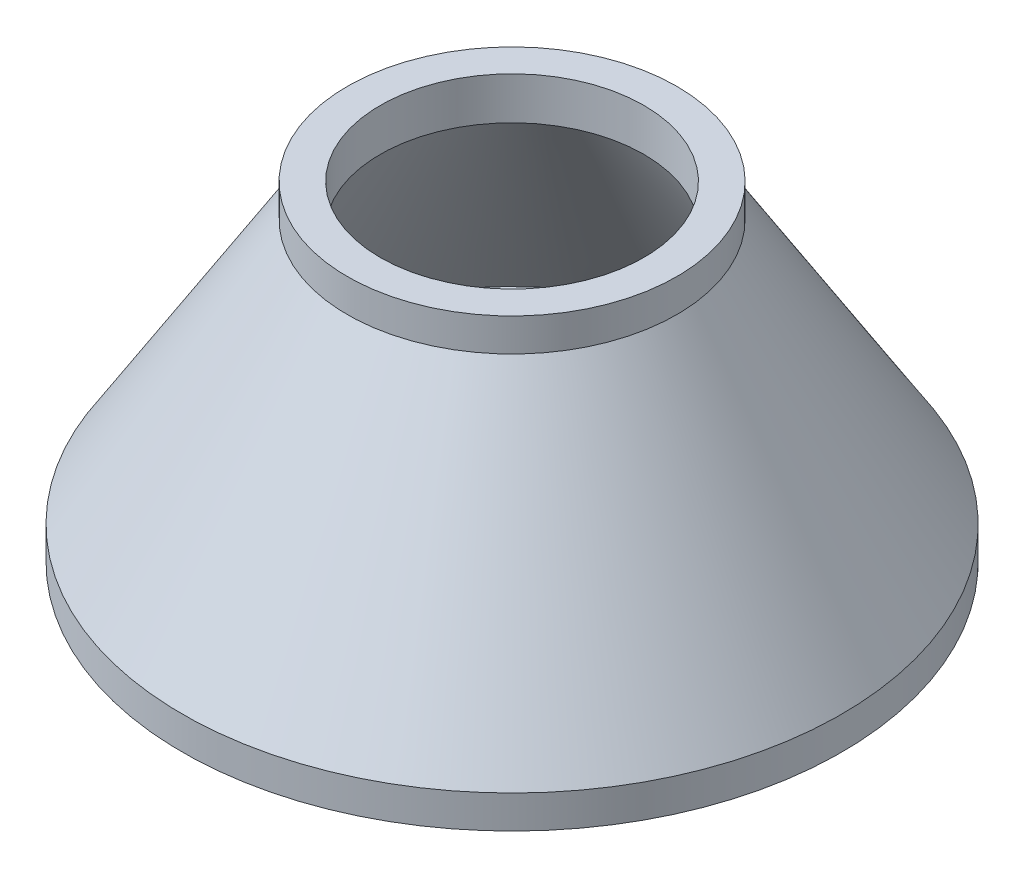
ISO-10303-21;
HEADER;
FILE_DESCRIPTION(('STEP AP214'),'2;1');
FILE_NAME('part.step','',(''),(''),'','','');
FILE_SCHEMA(('AUTOMOTIVE_DESIGN { 1 0 10303 214 1 1 1 1 }'));
ENDSEC;
DATA;
#1=APPLICATION_CONTEXT('core data for automotive mechanical design processes');
#2=APPLICATION_PROTOCOL_DEFINITION('international standard','automotive_design',2000,#1);
#3=PRODUCT_CONTEXT('',#1,'mechanical');
#4=PRODUCT('Part','Part','',(#3));
#5=PRODUCT_RELATED_PRODUCT_CATEGORY('part','',(#4));
#6=PRODUCT_DEFINITION_FORMATION('','',#4);
#7=PRODUCT_DEFINITION_CONTEXT('part definition',#1,'design');
#8=PRODUCT_DEFINITION('design','',#6,#7);
#9=PRODUCT_DEFINITION_SHAPE('','',#8);
#10=(LENGTH_UNIT() NAMED_UNIT(*) SI_UNIT(.MILLI.,.METRE.));
#11=(NAMED_UNIT(*) PLANE_ANGLE_UNIT() SI_UNIT($,.RADIAN.));
#12=(NAMED_UNIT(*) SI_UNIT($,.STERADIAN.) SOLID_ANGLE_UNIT());
#13=UNCERTAINTY_MEASURE_WITH_UNIT(LENGTH_MEASURE(1.E-05),#10,'distance_accuracy_value','');
#14=(GEOMETRIC_REPRESENTATION_CONTEXT(3) GLOBAL_UNCERTAINTY_ASSIGNED_CONTEXT((#13)) GLOBAL_UNIT_ASSIGNED_CONTEXT((#10,
#11,#12)) REPRESENTATION_CONTEXT('',''));
#15=CARTESIAN_POINT('',(0.,0.,0.));
#16=DIRECTION('',(0.,0.,1.));
#17=DIRECTION('',(1.,0.,0.));
#18=AXIS2_PLACEMENT_3D('',#15,#16,#17);
#19=CARTESIAN_POINT('',(0.,0.,0.));
#20=DIRECTION('',(0.,-1.,0.));
#21=DIRECTION('',(0.,0.,-1.));
#22=AXIS2_PLACEMENT_3D('',#19,#20,#21);
#23=PLANE('',#22);
#24=CARTESIAN_POINT('',(0.,0.,0.));
#25=DIRECTION('',(0.,-1.,0.));
#26=DIRECTION('',(0.,0.,-1.));
#27=AXIS2_PLACEMENT_3D('',#24,#25,#26);
#28=CIRCLE('',#27,100.);
#29=CARTESIAN_POINT('',(0.,0.,-100.));
#30=VERTEX_POINT('',#29);
#31=EDGE_CURVE('E10',#30,#30,#28,.T.);
#32=ORIENTED_EDGE('',*,*,#31,.T.);
#33=EDGE_LOOP('',(#32));
#34=FACE_BOUND('',#33,.T.);
#35=ADVANCED_FACE('F31',(#34),#23,.T.);
#36=CARTESIAN_POINT('',(0.,0.,0.));
#37=DIRECTION('',(0.,-1.,0.));
#38=DIRECTION('',(0.,0.,-1.));
#39=AXIS2_PLACEMENT_3D('',#36,#37,#38);
#40=CYLINDRICAL_SURFACE('',#39,100.);
#41=CARTESIAN_POINT('',(0.,10.,0.));
#42=DIRECTION('',(0.,-1.,0.));
#43=DIRECTION('',(0.,0.,-1.));
#44=AXIS2_PLACEMENT_3D('',#41,#42,#43);
#45=CIRCLE('',#44,100.);
#46=CARTESIAN_POINT('',(0.,10.,-100.));
#47=VERTEX_POINT('',#46);
#48=EDGE_CURVE('E37',#47,#47,#45,.T.);
#49=ORIENTED_EDGE('',*,*,#48,.T.);
#50=EDGE_LOOP('',(#49));
#51=FACE_BOUND('',#50,.T.);
#52=ORIENTED_EDGE('',*,*,#31,.F.);
#53=EDGE_LOOP('',(#52));
#54=FACE_BOUND('',#53,.T.);
#55=ADVANCED_FACE('F78',(#51,#54),#40,.T.);
#56=CARTESIAN_POINT('',(0.,10.,0.));
#57=DIRECTION('',(0.,-1.,0.));
#58=DIRECTION('',(0.,0.,-1.));
#59=AXIS2_PLACEMENT_3D('',#56,#57,#58);
#60=CONICAL_SURFACE('',#59,100.,0.558599315343562);
#61=CARTESIAN_POINT('',(0.,90.,0.));
#62=DIRECTION('',(0.,-1.,0.));
#63=DIRECTION('',(0.,0.,-1.));
#64=AXIS2_PLACEMENT_3D('',#61,#62,#63);
#65=CIRCLE('',#64,50.);
#66=CARTESIAN_POINT('',(0.,90.,-50.));
#67=VERTEX_POINT('',#66);
#68=EDGE_CURVE('E41',#67,#67,#65,.T.);
#69=ORIENTED_EDGE('',*,*,#68,.T.);
#70=EDGE_LOOP('',(#69));
#71=FACE_BOUND('',#70,.T.);
#72=ORIENTED_EDGE('',*,*,#48,.F.);
#73=EDGE_LOOP('',(#72));
#74=FACE_BOUND('',#73,.T.);
#75=ADVANCED_FACE('F82',(#71,#74),#60,.T.);
#76=CARTESIAN_POINT('',(0.,0.,0.));
#77=DIRECTION('',(0.,-1.,0.));
#78=DIRECTION('',(0.,0.,-1.));
#79=AXIS2_PLACEMENT_3D('',#76,#77,#78);
#80=CYLINDRICAL_SURFACE('',#79,50.);
#81=CARTESIAN_POINT('',(0.,100.,0.));
#82=DIRECTION('',(0.,-1.,0.));
#83=DIRECTION('',(0.,0.,-1.));
#84=AXIS2_PLACEMENT_3D('',#81,#82,#83);
#85=CIRCLE('',#84,50.);
#86=CARTESIAN_POINT('',(0.,100.,-50.));
#87=VERTEX_POINT('',#86);
#88=EDGE_CURVE('E45',#87,#87,#85,.T.);
#89=ORIENTED_EDGE('',*,*,#88,.T.);
#90=EDGE_LOOP('',(#89));
#91=FACE_BOUND('',#90,.T.);
#92=ORIENTED_EDGE('',*,*,#68,.F.);
#93=EDGE_LOOP('',(#92));
#94=FACE_BOUND('',#93,.T.);
#95=ADVANCED_FACE('F86',(#91,#94),#80,.T.);
#96=CARTESIAN_POINT('',(50.,100.,0.));
#97=DIRECTION('',(0.,1.,0.));
#98=DIRECTION('',(0.,0.,1.));
#99=AXIS2_PLACEMENT_3D('',#96,#97,#98);
#100=PLANE('',#99);
#101=CARTESIAN_POINT('',(0.,100.,0.));
#102=DIRECTION('',(0.,1.,0.));
#103=DIRECTION('',(0.,0.,1.));
#104=AXIS2_PLACEMENT_3D('',#101,#102,#103);
#105=CIRCLE('',#104,40.);
#106=CARTESIAN_POINT('',(0.,100.,40.));
#107=VERTEX_POINT('',#106);
#108=EDGE_CURVE('E54',#107,#107,#105,.F.);
#109=ORIENTED_EDGE('',*,*,#108,.T.);
#110=EDGE_LOOP('',(#109));
#111=FACE_BOUND('',#110,.T.);
#112=ORIENTED_EDGE('',*,*,#88,.F.);
#113=EDGE_LOOP('',(#112));
#114=FACE_BOUND('',#113,.T.);
#115=ADVANCED_FACE('F66',(#111,#114),#100,.T.);
#116=CARTESIAN_POINT('',(0.,4.7000105999682,0.));
#117=DIRECTION('',(0.,-1.,0.));
#118=DIRECTION('',(0.,0.,-1.));
#119=AXIS2_PLACEMENT_3D('',#116,#117,#118);
#120=CONICAL_SURFACE('',#119,91.5200169599491,0.558599315343562);
#121=CARTESIAN_POINT('',(0.,87.1320377358869,0.));
#122=DIRECTION('',(0.,-1.,0.));
#123=DIRECTION('',(0.,0.,-1.));
#124=AXIS2_PLACEMENT_3D('',#121,#122,#123);
#125=CIRCLE('',#124,40.);
#126=CARTESIAN_POINT('',(0.,87.1320377358869,-40.));
#127=VERTEX_POINT('',#126);
#128=EDGE_CURVE('E53',#127,#127,#125,.T.);
#129=ORIENTED_EDGE('',*,*,#128,.F.);
#130=EDGE_LOOP('',(#129));
#131=FACE_BOUND('',#130,.T.);
#132=CARTESIAN_POINT('',(0.,10.,0.));
#133=DIRECTION('',(0.,-1.,0.));
#134=DIRECTION('',(0.,0.,-1.));
#135=AXIS2_PLACEMENT_3D('',#132,#133,#134);
#136=CIRCLE('',#135,88.2075235849293);
#137=CARTESIAN_POINT('',(0.,10.,-88.2075235849293));
#138=VERTEX_POINT('',#137);
#139=EDGE_CURVE('E50',#138,#138,#136,.F.);
#140=ORIENTED_EDGE('',*,*,#139,.F.);
#141=EDGE_LOOP('',(#140));
#142=FACE_BOUND('',#141,.T.);
#143=ADVANCED_FACE('F62',(#131,#142),#120,.F.);
#144=CARTESIAN_POINT('',(0.,10.,0.));
#145=DIRECTION('',(0.,-1.,0.));
#146=DIRECTION('',(0.,0.,-1.));
#147=AXIS2_PLACEMENT_3D('',#144,#145,#146);
#148=PLANE('',#147);
#149=ORIENTED_EDGE('',*,*,#139,.T.);
#150=EDGE_LOOP('',(#149));
#151=FACE_BOUND('',#150,.T.);
#152=ADVANCED_FACE('F65',(#151),#148,.F.);
#153=CARTESIAN_POINT('',(0.,0.,0.));
#154=DIRECTION('',(0.,-1.,0.));
#155=DIRECTION('',(0.,0.,-1.));
#156=AXIS2_PLACEMENT_3D('',#153,#154,#155);
#157=CYLINDRICAL_SURFACE('',#156,40.);
#158=ORIENTED_EDGE('',*,*,#108,.F.);
#159=EDGE_LOOP('',(#158));
#160=FACE_BOUND('',#159,.T.);
#161=ORIENTED_EDGE('',*,*,#128,.T.);
#162=EDGE_LOOP('',(#161));
#163=FACE_BOUND('',#162,.T.);
#164=ADVANCED_FACE('F60',(#160,#163),#157,.F.);
#165=CLOSED_SHELL('',(#35,#55,#75,#95,#115,#143,#152,#164));
#166=MANIFOLD_SOLID_BREP('B2',#165);
#167=ADVANCED_BREP_SHAPE_REPRESENTATION('',(#18,#166),#14);
#168=SHAPE_DEFINITION_REPRESENTATION(#9,#167);
ENDSEC;
END-ISO-10303-21;
